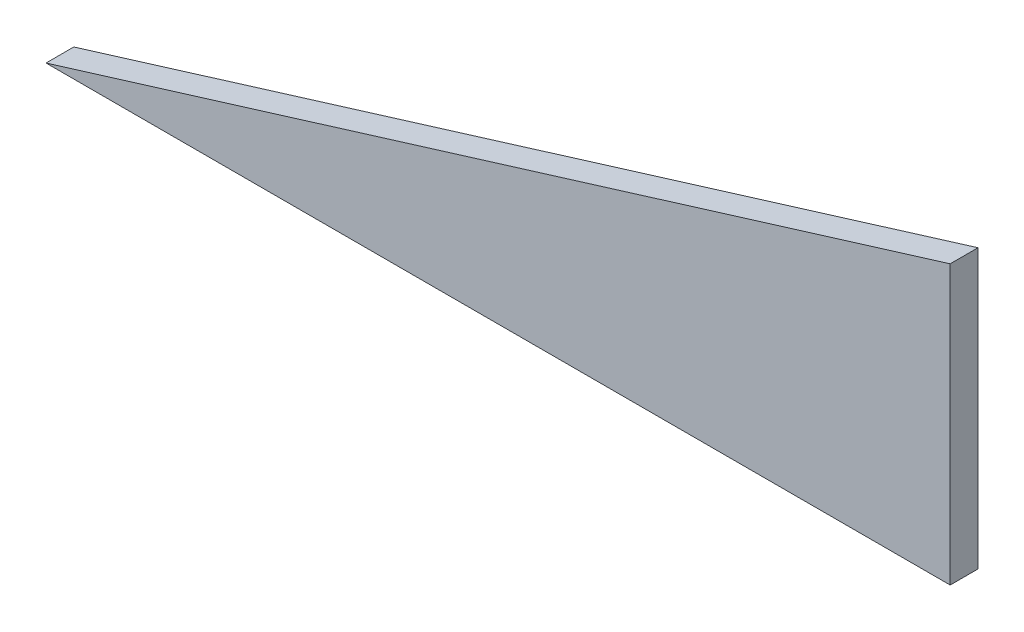
ISO-10303-21;
HEADER;
FILE_DESCRIPTION(('STEP AP214'),'2;1');
FILE_NAME('part.step','',(''),(''),'','','');
FILE_SCHEMA(('AUTOMOTIVE_DESIGN { 1 0 10303 214 1 1 1 1 }'));
ENDSEC;
DATA;
#1=APPLICATION_CONTEXT('core data for automotive mechanical design processes');
#2=APPLICATION_PROTOCOL_DEFINITION('international standard','automotive_design',2000,#1);
#3=PRODUCT_CONTEXT('',#1,'mechanical');
#4=PRODUCT('Part','Part','',(#3));
#5=PRODUCT_RELATED_PRODUCT_CATEGORY('part','',(#4));
#6=PRODUCT_DEFINITION_FORMATION('','',#4);
#7=PRODUCT_DEFINITION_CONTEXT('part definition',#1,'design');
#8=PRODUCT_DEFINITION('design','',#6,#7);
#9=PRODUCT_DEFINITION_SHAPE('','',#8);
#10=(LENGTH_UNIT() NAMED_UNIT(*) SI_UNIT(.MILLI.,.METRE.));
#11=(NAMED_UNIT(*) PLANE_ANGLE_UNIT() SI_UNIT($,.RADIAN.));
#12=(NAMED_UNIT(*) SI_UNIT($,.STERADIAN.) SOLID_ANGLE_UNIT());
#13=UNCERTAINTY_MEASURE_WITH_UNIT(LENGTH_MEASURE(1.E-05),#10,'distance_accuracy_value','');
#14=(GEOMETRIC_REPRESENTATION_CONTEXT(3) GLOBAL_UNCERTAINTY_ASSIGNED_CONTEXT((#13)) GLOBAL_UNIT_ASSIGNED_CONTEXT((#10,
#11,#12)) REPRESENTATION_CONTEXT('',''));
#15=CARTESIAN_POINT('',(0.,0.,0.));
#16=DIRECTION('',(0.,0.,1.));
#17=DIRECTION('',(1.,0.,0.));
#18=AXIS2_PLACEMENT_3D('',#15,#16,#17);
#19=CARTESIAN_POINT('',(0.,80.,-8.));
#20=DIRECTION('',(1.,0.,0.));
#21=DIRECTION('',(0.,0.,-1.));
#22=AXIS2_PLACEMENT_3D('',#19,#20,#21);
#23=PLANE('',#22);
#24=DIRECTION('',(0.,1.,0.));
#25=VECTOR('',#24,1.);
#26=CARTESIAN_POINT('',(0.,80.,0.));
#27=LINE('',#26,#25);
#28=CARTESIAN_POINT('',(0.,0.,0.));
#29=VERTEX_POINT('',#28);
#30=CARTESIAN_POINT('',(0.,80.,0.));
#31=VERTEX_POINT('',#30);
#32=EDGE_CURVE('E94',#29,#31,#27,.T.);
#33=ORIENTED_EDGE('',*,*,#32,.F.);
#34=DIRECTION('',(0.,0.,1.));
#35=VECTOR('',#34,1.);
#36=CARTESIAN_POINT('',(0.,0.,-8.));
#37=LINE('',#36,#35);
#38=CARTESIAN_POINT('',(0.,0.,-8.));
#39=VERTEX_POINT('',#38);
#40=EDGE_CURVE('E11',#39,#29,#37,.T.);
#41=ORIENTED_EDGE('',*,*,#40,.F.);
#42=DIRECTION('',(0.,1.,0.));
#43=VECTOR('',#42,1.);
#44=CARTESIAN_POINT('',(0.,80.,-8.));
#45=LINE('',#44,#43);
#46=CARTESIAN_POINT('',(0.,80.,-8.));
#47=VERTEX_POINT('',#46);
#48=EDGE_CURVE('E86',#39,#47,#45,.T.);
#49=ORIENTED_EDGE('',*,*,#48,.T.);
#50=DIRECTION('',(0.,0.,1.));
#51=VECTOR('',#50,1.);
#52=CARTESIAN_POINT('',(0.,80.,-8.));
#53=LINE('',#52,#51);
#54=EDGE_CURVE('E45',#47,#31,#53,.T.);
#55=ORIENTED_EDGE('',*,*,#54,.T.);
#56=EDGE_LOOP('',(#33,#41,#49,#55));
#57=FACE_BOUND('',#56,.T.);
#58=ADVANCED_FACE('F42',(#57),#23,.T.);
#59=CARTESIAN_POINT('',(0.,0.,-8.));
#60=DIRECTION('',(0.,-1.,0.));
#61=DIRECTION('',(1.,0.,0.));
#62=AXIS2_PLACEMENT_3D('',#59,#60,#61);
#63=PLANE('',#62);
#64=DIRECTION('',(1.,0.,0.));
#65=VECTOR('',#64,1.);
#66=CARTESIAN_POINT('',(0.,0.,0.));
#67=LINE('',#66,#65);
#68=CARTESIAN_POINT('',(-260.,0.,0.));
#69=VERTEX_POINT('',#68);
#70=EDGE_CURVE('E88',#69,#29,#67,.T.);
#71=ORIENTED_EDGE('',*,*,#70,.F.);
#72=DIRECTION('',(0.,0.,1.));
#73=VECTOR('',#72,1.);
#74=CARTESIAN_POINT('',(-260.,0.,-8.));
#75=LINE('',#74,#73);
#76=CARTESIAN_POINT('',(-260.,0.,-8.));
#77=VERTEX_POINT('',#76);
#78=EDGE_CURVE('E51',#77,#69,#75,.T.);
#79=ORIENTED_EDGE('',*,*,#78,.F.);
#80=DIRECTION('',(1.,0.,0.));
#81=VECTOR('',#80,1.);
#82=CARTESIAN_POINT('',(0.,0.,-8.));
#83=LINE('',#82,#81);
#84=EDGE_CURVE('E83',#77,#39,#83,.T.);
#85=ORIENTED_EDGE('',*,*,#84,.T.);
#86=ORIENTED_EDGE('',*,*,#40,.T.);
#87=EDGE_LOOP('',(#71,#79,#85,#86));
#88=FACE_BOUND('',#87,.T.);
#89=ADVANCED_FACE('F98',(#88),#63,.T.);
#90=CARTESIAN_POINT('',(-260.,0.,-8.));
#91=DIRECTION('',(-0.294085848837523,0.95577900872195,0.));
#92=DIRECTION('',(-0.95577900872195,-0.294085848837523,0.));
#93=AXIS2_PLACEMENT_3D('',#90,#91,#92);
#94=PLANE('',#93);
#95=DIRECTION('',(-0.95577900872195,-0.294085848837523,0.));
#96=VECTOR('',#95,1.);
#97=CARTESIAN_POINT('',(-260.,0.,0.));
#98=LINE('',#97,#96);
#99=EDGE_CURVE('E81',#31,#69,#98,.T.);
#100=ORIENTED_EDGE('',*,*,#99,.F.);
#101=ORIENTED_EDGE('',*,*,#54,.F.);
#102=DIRECTION('',(-0.95577900872195,-0.294085848837523,0.));
#103=VECTOR('',#102,1.);
#104=CARTESIAN_POINT('',(-260.,0.,-8.));
#105=LINE('',#104,#103);
#106=EDGE_CURVE('E79',#47,#77,#105,.T.);
#107=ORIENTED_EDGE('',*,*,#106,.T.);
#108=ORIENTED_EDGE('',*,*,#78,.T.);
#109=EDGE_LOOP('',(#100,#101,#107,#108));
#110=FACE_BOUND('',#109,.T.);
#111=ADVANCED_FACE('F78',(#110),#94,.T.);
#112=CARTESIAN_POINT('',(0.,0.,-8.));
#113=DIRECTION('',(0.,0.,-1.));
#114=DIRECTION('',(-1.,0.,0.));
#115=AXIS2_PLACEMENT_3D('',#112,#113,#114);
#116=PLANE('',#115);
#117=ORIENTED_EDGE('',*,*,#48,.F.);
#118=ORIENTED_EDGE('',*,*,#84,.F.);
#119=ORIENTED_EDGE('',*,*,#106,.F.);
#120=EDGE_LOOP('',(#117,#118,#119));
#121=FACE_BOUND('',#120,.T.);
#122=ADVANCED_FACE('F85',(#121),#116,.T.);
#123=CARTESIAN_POINT('',(0.,0.,0.));
#124=DIRECTION('',(0.,0.,-1.));
#125=DIRECTION('',(-1.,0.,0.));
#126=AXIS2_PLACEMENT_3D('',#123,#124,#125);
#127=PLANE('',#126);
#128=ORIENTED_EDGE('',*,*,#32,.T.);
#129=ORIENTED_EDGE('',*,*,#99,.T.);
#130=ORIENTED_EDGE('',*,*,#70,.T.);
#131=EDGE_LOOP('',(#128,#129,#130));
#132=FACE_BOUND('',#131,.T.);
#133=ADVANCED_FACE('F97',(#132),#127,.F.);
#134=CLOSED_SHELL('',(#58,#89,#111,#122,#133));
#135=MANIFOLD_SOLID_BREP('B2',#134);
#136=ADVANCED_BREP_SHAPE_REPRESENTATION('',(#18,#135),#14);
#137=SHAPE_DEFINITION_REPRESENTATION(#9,#136);
ENDSEC;
END-ISO-10303-21;
